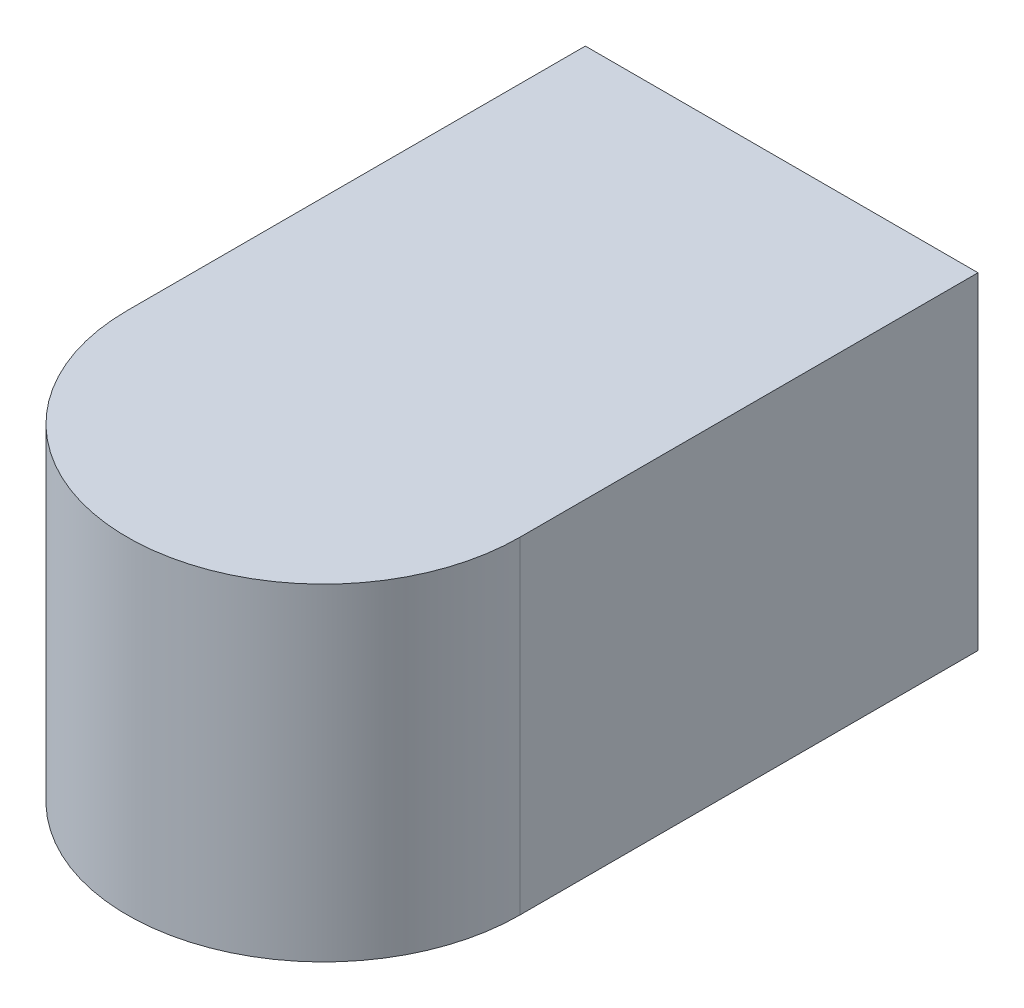
ISO-10303-21;
HEADER;
FILE_DESCRIPTION(('STEP AP214'),'2;1');
FILE_NAME('part.step','',(''),(''),'','','');
FILE_SCHEMA(('AUTOMOTIVE_DESIGN { 1 0 10303 214 1 1 1 1 }'));
ENDSEC;
DATA;
#1=APPLICATION_CONTEXT('core data for automotive mechanical design processes');
#2=APPLICATION_PROTOCOL_DEFINITION('international standard','automotive_design',2000,#1);
#3=PRODUCT_CONTEXT('',#1,'mechanical');
#4=PRODUCT('Part','Part','',(#3));
#5=PRODUCT_RELATED_PRODUCT_CATEGORY('part','',(#4));
#6=PRODUCT_DEFINITION_FORMATION('','',#4);
#7=PRODUCT_DEFINITION_CONTEXT('part definition',#1,'design');
#8=PRODUCT_DEFINITION('design','',#6,#7);
#9=PRODUCT_DEFINITION_SHAPE('','',#8);
#10=(LENGTH_UNIT() NAMED_UNIT(*) SI_UNIT(.MILLI.,.METRE.));
#11=(NAMED_UNIT(*) PLANE_ANGLE_UNIT() SI_UNIT($,.RADIAN.));
#12=(NAMED_UNIT(*) SI_UNIT($,.STERADIAN.) SOLID_ANGLE_UNIT());
#13=UNCERTAINTY_MEASURE_WITH_UNIT(LENGTH_MEASURE(1.E-05),#10,'distance_accuracy_value','');
#14=(GEOMETRIC_REPRESENTATION_CONTEXT(3) GLOBAL_UNCERTAINTY_ASSIGNED_CONTEXT((#13)) GLOBAL_UNIT_ASSIGNED_CONTEXT((#10,
#11,#12)) REPRESENTATION_CONTEXT('',''));
#15=CARTESIAN_POINT('',(0.,0.,0.));
#16=DIRECTION('',(0.,0.,1.));
#17=DIRECTION('',(1.,0.,0.));
#18=AXIS2_PLACEMENT_3D('',#15,#16,#17);
#19=CARTESIAN_POINT('',(0.,0.,0.));
#20=DIRECTION('',(0.,1.,0.));
#21=DIRECTION('',(1.,0.,0.));
#22=AXIS2_PLACEMENT_3D('',#19,#20,#21);
#23=PLANE('',#22);
#24=DIRECTION('',(-1.,0.,0.));
#25=VECTOR('',#24,1.);
#26=CARTESIAN_POINT('',(-0.63,0.,-2.25));
#27=LINE('',#26,#25);
#28=CARTESIAN_POINT('',(-0.63,0.,-2.25));
#29=VERTEX_POINT('',#28);
#30=CARTESIAN_POINT('',(-0.87,0.,-2.25));
#31=VERTEX_POINT('',#30);
#32=EDGE_CURVE('E11',#29,#31,#27,.T.);
#33=ORIENTED_EDGE('',*,*,#32,.F.);
#34=DIRECTION('',(0.,0.,-1.));
#35=VECTOR('',#34,1.);
#36=CARTESIAN_POINT('',(-0.63,0.,-1.97));
#37=LINE('',#36,#35);
#38=CARTESIAN_POINT('',(-0.63,0.,-1.97));
#39=VERTEX_POINT('',#38);
#40=EDGE_CURVE('E24',#39,#29,#37,.T.);
#41=ORIENTED_EDGE('',*,*,#40,.F.);
#42=CARTESIAN_POINT('',(-0.75,0.,-1.97));
#43=DIRECTION('',(0.,1.,0.));
#44=DIRECTION('',(-1.,0.,0.));
#45=AXIS2_PLACEMENT_3D('',#42,#43,#44);
#46=CIRCLE('',#45,0.12);
#47=CARTESIAN_POINT('',(-0.87,0.,-1.97));
#48=VERTEX_POINT('',#47);
#49=EDGE_CURVE('E61',#48,#39,#46,.T.);
#50=ORIENTED_EDGE('',*,*,#49,.F.);
#51=DIRECTION('',(0.,0.,1.));
#52=VECTOR('',#51,1.);
#53=CARTESIAN_POINT('',(-0.87,0.,-2.25));
#54=LINE('',#53,#52);
#55=EDGE_CURVE('E37',#31,#48,#54,.T.);
#56=ORIENTED_EDGE('',*,*,#55,.F.);
#57=EDGE_LOOP('',(#33,#41,#50,#56));
#58=FACE_BOUND('',#57,.T.);
#59=ADVANCED_FACE('F17',(#58),#23,.F.);
#60=CARTESIAN_POINT('',(-0.87,0.,-2.25));
#61=DIRECTION('',(-1.,0.,0.));
#62=DIRECTION('',(0.,0.,1.));
#63=AXIS2_PLACEMENT_3D('',#60,#61,#62);
#64=PLANE('',#63);
#65=DIRECTION('',(0.,1.,0.));
#66=VECTOR('',#65,1.);
#67=CARTESIAN_POINT('',(-0.87,0.,-1.97));
#68=LINE('',#67,#66);
#69=CARTESIAN_POINT('',(-0.87,0.2,-1.97));
#70=VERTEX_POINT('',#69);
#71=EDGE_CURVE('E84',#48,#70,#68,.T.);
#72=ORIENTED_EDGE('',*,*,#71,.T.);
#73=DIRECTION('',(0.,0.,1.));
#74=VECTOR('',#73,1.);
#75=CARTESIAN_POINT('',(-0.87,0.2,-2.25));
#76=LINE('',#75,#74);
#77=CARTESIAN_POINT('',(-0.87,0.2,-2.25));
#78=VERTEX_POINT('',#77);
#79=EDGE_CURVE('E74',#78,#70,#76,.T.);
#80=ORIENTED_EDGE('',*,*,#79,.F.);
#81=DIRECTION('',(0.,1.,0.));
#82=VECTOR('',#81,1.);
#83=CARTESIAN_POINT('',(-0.87,0.,-2.25));
#84=LINE('',#83,#82);
#85=EDGE_CURVE('E81',#31,#78,#84,.T.);
#86=ORIENTED_EDGE('',*,*,#85,.F.);
#87=ORIENTED_EDGE('',*,*,#55,.T.);
#88=EDGE_LOOP('',(#72,#80,#86,#87));
#89=FACE_BOUND('',#88,.T.);
#90=ADVANCED_FACE('F89',(#89),#64,.T.);
#91=CARTESIAN_POINT('',(-0.63,0.,-2.25));
#92=DIRECTION('',(0.,0.,-1.));
#93=DIRECTION('',(-1.,0.,0.));
#94=AXIS2_PLACEMENT_3D('',#91,#92,#93);
#95=PLANE('',#94);
#96=ORIENTED_EDGE('',*,*,#85,.T.);
#97=DIRECTION('',(-1.,0.,0.));
#98=VECTOR('',#97,1.);
#99=CARTESIAN_POINT('',(-0.63,0.2,-2.25));
#100=LINE('',#99,#98);
#101=CARTESIAN_POINT('',(-0.63,0.2,-2.25));
#102=VERTEX_POINT('',#101);
#103=EDGE_CURVE('E79',#102,#78,#100,.T.);
#104=ORIENTED_EDGE('',*,*,#103,.F.);
#105=DIRECTION('',(0.,1.,0.));
#106=VECTOR('',#105,1.);
#107=CARTESIAN_POINT('',(-0.63,0.,-2.25));
#108=LINE('',#107,#106);
#109=EDGE_CURVE('E67',#29,#102,#108,.T.);
#110=ORIENTED_EDGE('',*,*,#109,.F.);
#111=ORIENTED_EDGE('',*,*,#32,.T.);
#112=EDGE_LOOP('',(#96,#104,#110,#111));
#113=FACE_BOUND('',#112,.T.);
#114=ADVANCED_FACE('F91',(#113),#95,.T.);
#115=CARTESIAN_POINT('',(-0.63,0.,-1.97));
#116=DIRECTION('',(1.,0.,0.));
#117=DIRECTION('',(0.,0.,-1.));
#118=AXIS2_PLACEMENT_3D('',#115,#116,#117);
#119=PLANE('',#118);
#120=ORIENTED_EDGE('',*,*,#109,.T.);
#121=DIRECTION('',(0.,0.,-1.));
#122=VECTOR('',#121,1.);
#123=CARTESIAN_POINT('',(-0.63,0.2,-1.97));
#124=LINE('',#123,#122);
#125=CARTESIAN_POINT('',(-0.63,0.2,-1.97));
#126=VERTEX_POINT('',#125);
#127=EDGE_CURVE('E62',#126,#102,#124,.T.);
#128=ORIENTED_EDGE('',*,*,#127,.F.);
#129=DIRECTION('',(0.,1.,0.));
#130=VECTOR('',#129,1.);
#131=CARTESIAN_POINT('',(-0.63,0.,-1.97));
#132=LINE('',#131,#130);
#133=EDGE_CURVE('E55',#39,#126,#132,.T.);
#134=ORIENTED_EDGE('',*,*,#133,.F.);
#135=ORIENTED_EDGE('',*,*,#40,.T.);
#136=EDGE_LOOP('',(#120,#128,#134,#135));
#137=FACE_BOUND('',#136,.T.);
#138=ADVANCED_FACE('F65',(#137),#119,.T.);
#139=CARTESIAN_POINT('',(-0.75,0.,-1.97));
#140=DIRECTION('',(0.,1.,0.));
#141=DIRECTION('',(1.,0.,0.));
#142=AXIS2_PLACEMENT_3D('',#139,#140,#141);
#143=CYLINDRICAL_SURFACE('',#142,0.12);
#144=ORIENTED_EDGE('',*,*,#133,.T.);
#145=CARTESIAN_POINT('',(-0.75,0.2,-1.97));
#146=DIRECTION('',(0.,1.,0.));
#147=DIRECTION('',(-1.,0.,0.));
#148=AXIS2_PLACEMENT_3D('',#145,#146,#147);
#149=CIRCLE('',#148,0.12);
#150=EDGE_CURVE('E60',#70,#126,#149,.T.);
#151=ORIENTED_EDGE('',*,*,#150,.F.);
#152=ORIENTED_EDGE('',*,*,#71,.F.);
#153=ORIENTED_EDGE('',*,*,#49,.T.);
#154=EDGE_LOOP('',(#144,#151,#152,#153));
#155=FACE_BOUND('',#154,.T.);
#156=ADVANCED_FACE('F57',(#155),#143,.T.);
#157=CARTESIAN_POINT('',(0.,0.2,0.));
#158=DIRECTION('',(0.,1.,0.));
#159=DIRECTION('',(1.,0.,0.));
#160=AXIS2_PLACEMENT_3D('',#157,#158,#159);
#161=PLANE('',#160);
#162=ORIENTED_EDGE('',*,*,#150,.T.);
#163=ORIENTED_EDGE('',*,*,#127,.T.);
#164=ORIENTED_EDGE('',*,*,#103,.T.);
#165=ORIENTED_EDGE('',*,*,#79,.T.);
#166=EDGE_LOOP('',(#162,#163,#164,#165));
#167=FACE_BOUND('',#166,.T.);
#168=ADVANCED_FACE('F72',(#167),#161,.T.);
#169=CLOSED_SHELL('',(#59,#90,#114,#138,#156,#168));
#170=MANIFOLD_SOLID_BREP('B1',#169);
#171=ADVANCED_BREP_SHAPE_REPRESENTATION('',(#18,#170),#14);
#172=SHAPE_DEFINITION_REPRESENTATION(#9,#171);
ENDSEC;
END-ISO-10303-21;
